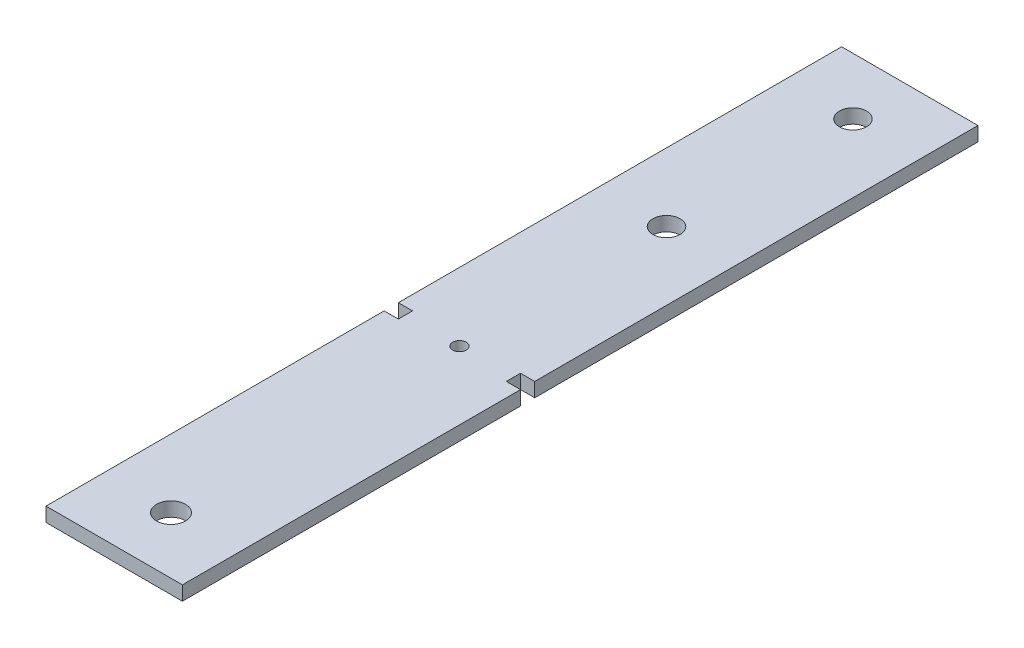
ISO-10303-21;
HEADER;
FILE_DESCRIPTION(('STEP AP214'),'2;1');
FILE_NAME('part.step','',(''),(''),'','','');
FILE_SCHEMA(('AUTOMOTIVE_DESIGN { 1 0 10303 214 1 1 1 1 }'));
ENDSEC;
DATA;
#1=APPLICATION_CONTEXT('core data for automotive mechanical design processes');
#2=APPLICATION_PROTOCOL_DEFINITION('international standard','automotive_design',2000,#1);
#3=PRODUCT_CONTEXT('',#1,'mechanical');
#4=PRODUCT('Part','Part','',(#3));
#5=PRODUCT_RELATED_PRODUCT_CATEGORY('part','',(#4));
#6=PRODUCT_DEFINITION_FORMATION('','',#4);
#7=PRODUCT_DEFINITION_CONTEXT('part definition',#1,'design');
#8=PRODUCT_DEFINITION('design','',#6,#7);
#9=PRODUCT_DEFINITION_SHAPE('','',#8);
#10=(LENGTH_UNIT() NAMED_UNIT(*) SI_UNIT(.MILLI.,.METRE.));
#11=(NAMED_UNIT(*) PLANE_ANGLE_UNIT() SI_UNIT($,.RADIAN.));
#12=(NAMED_UNIT(*) SI_UNIT($,.STERADIAN.) SOLID_ANGLE_UNIT());
#13=UNCERTAINTY_MEASURE_WITH_UNIT(LENGTH_MEASURE(1.E-05),#10,'distance_accuracy_value','');
#14=(GEOMETRIC_REPRESENTATION_CONTEXT(3) GLOBAL_UNCERTAINTY_ASSIGNED_CONTEXT((#13)) GLOBAL_UNIT_ASSIGNED_CONTEXT((#10,
#11,#12)) REPRESENTATION_CONTEXT('',''));
#15=CARTESIAN_POINT('',(0.,0.,0.));
#16=DIRECTION('',(0.,0.,1.));
#17=DIRECTION('',(1.,0.,0.));
#18=AXIS2_PLACEMENT_3D('',#15,#16,#17);
#19=CARTESIAN_POINT('',(-44.5847902895759,3.175,13.335));
#20=DIRECTION('',(0.,-1.,0.));
#21=DIRECTION('',(0.,0.,-1.));
#22=AXIS2_PLACEMENT_3D('',#19,#20,#21);
#23=PLANE('',#22);
#24=CARTESIAN_POINT('',(-32.5197902895764,3.175,11.7475));
#25=DIRECTION('',(0.,1.,0.));
#26=DIRECTION('',(0.,0.,1.));
#27=AXIS2_PLACEMENT_3D('',#24,#25,#26);
#28=CIRCLE('',#27,1.524);
#29=CARTESIAN_POINT('',(-32.5197902895764,3.175,13.2715));
#30=VERTEX_POINT('',#29);
#31=EDGE_CURVE('E291',#30,#30,#28,.T.);
#32=ORIENTED_EDGE('',*,*,#31,.F.);
#33=EDGE_LOOP('',(#32));
#34=FACE_BOUND('',#33,.T.);
#35=CARTESIAN_POINT('',(-32.5197902895762,3.175,-34.5292679999996));
#36=DIRECTION('',(0.,1.,0.));
#37=DIRECTION('',(0.,0.,-1.));
#38=AXIS2_PLACEMENT_3D('',#35,#36,#37);
#39=CIRCLE('',#38,3.048);
#40=CARTESIAN_POINT('',(-32.5197902895762,3.175,-37.5772679999996));
#41=VERTEX_POINT('',#40);
#42=EDGE_CURVE('E157',#41,#41,#39,.T.);
#43=ORIENTED_EDGE('',*,*,#42,.F.);
#44=EDGE_LOOP('',(#43));
#45=FACE_BOUND('',#44,.T.);
#46=DIRECTION('',(0.,0.,1.));
#47=VECTOR('',#46,1.);
#48=CARTESIAN_POINT('',(-44.5847902895759,3.175,10.16));
#49=LINE('',#48,#47);
#50=CARTESIAN_POINT('',(-44.5847902895759,3.175,10.16));
#51=VERTEX_POINT('',#50);
#52=CARTESIAN_POINT('',(-44.5847902895759,3.175,13.335));
#53=VERTEX_POINT('',#52);
#54=EDGE_CURVE('E176',#51,#53,#49,.T.);
#55=ORIENTED_EDGE('',*,*,#54,.T.);
#56=DIRECTION('',(-1.,0.,0.));
#57=VECTOR('',#56,1.);
#58=CARTESIAN_POINT('',(-44.5847902895759,3.175,13.335));
#59=LINE('',#58,#57);
#60=CARTESIAN_POINT('',(-47.7597902895759,3.175,13.335));
#61=VERTEX_POINT('',#60);
#62=EDGE_CURVE('E104',#53,#61,#59,.T.);
#63=ORIENTED_EDGE('',*,*,#62,.T.);
#64=DIRECTION('',(0.,0.,1.));
#65=VECTOR('',#64,1.);
#66=CARTESIAN_POINT('',(-47.7597902895759,3.175,13.335));
#67=LINE('',#66,#65);
#68=CARTESIAN_POINT('',(-47.7597902895759,3.175,88.9));
#69=VERTEX_POINT('',#68);
#70=EDGE_CURVE('E203',#61,#69,#67,.T.);
#71=ORIENTED_EDGE('',*,*,#70,.T.);
#72=DIRECTION('',(1.,0.,0.));
#73=VECTOR('',#72,1.);
#74=CARTESIAN_POINT('',(-17.2797902895759,3.175,88.9));
#75=LINE('',#74,#73);
#76=CARTESIAN_POINT('',(-17.2797902895759,3.175,88.9));
#77=VERTEX_POINT('',#76);
#78=EDGE_CURVE('E222',#69,#77,#75,.T.);
#79=ORIENTED_EDGE('',*,*,#78,.T.);
#80=DIRECTION('',(0.,0.,-1.));
#81=VECTOR('',#80,1.);
#82=CARTESIAN_POINT('',(-17.2797902895759,3.175,13.335));
#83=LINE('',#82,#81);
#84=CARTESIAN_POINT('',(-17.2797902895759,3.175,13.335));
#85=VERTEX_POINT('',#84);
#86=EDGE_CURVE('E219',#77,#85,#83,.T.);
#87=ORIENTED_EDGE('',*,*,#86,.T.);
#88=DIRECTION('',(-1.,0.,0.));
#89=VECTOR('',#88,1.);
#90=CARTESIAN_POINT('',(-17.2797902895759,3.175,13.335));
#91=LINE('',#90,#89);
#92=CARTESIAN_POINT('',(-20.4547902895759,3.175,13.335));
#93=VERTEX_POINT('',#92);
#94=EDGE_CURVE('E221',#85,#93,#91,.T.);
#95=ORIENTED_EDGE('',*,*,#94,.T.);
#96=DIRECTION('',(0.,0.,-1.));
#97=VECTOR('',#96,1.);
#98=CARTESIAN_POINT('',(-20.4547902895759,3.175,13.335));
#99=LINE('',#98,#97);
#100=CARTESIAN_POINT('',(-20.4547902895759,3.175,10.16));
#101=VERTEX_POINT('',#100);
#102=EDGE_CURVE('E224',#93,#101,#99,.T.);
#103=ORIENTED_EDGE('',*,*,#102,.T.);
#104=DIRECTION('',(1.,0.,0.));
#105=VECTOR('',#104,1.);
#106=CARTESIAN_POINT('',(-20.4547902895759,3.175,10.16));
#107=LINE('',#106,#105);
#108=CARTESIAN_POINT('',(-17.2797902895759,3.175,10.16));
#109=VERTEX_POINT('',#108);
#110=EDGE_CURVE('E230',#101,#109,#107,.T.);
#111=ORIENTED_EDGE('',*,*,#110,.T.);
#112=DIRECTION('',(0.,0.,-1.));
#113=VECTOR('',#112,1.);
#114=CARTESIAN_POINT('',(-17.2797902895759,3.175,-88.9));
#115=LINE('',#114,#113);
#116=CARTESIAN_POINT('',(-17.2797902895759,3.175,-88.9));
#117=VERTEX_POINT('',#116);
#118=EDGE_CURVE('E135',#109,#117,#115,.T.);
#119=ORIENTED_EDGE('',*,*,#118,.T.);
#120=DIRECTION('',(-1.,0.,0.));
#121=VECTOR('',#120,1.);
#122=CARTESIAN_POINT('',(-17.2797902895759,3.175,-88.9));
#123=LINE('',#122,#121);
#124=CARTESIAN_POINT('',(-47.7597902895759,3.175,-88.9));
#125=VERTEX_POINT('',#124);
#126=EDGE_CURVE('E129',#117,#125,#123,.T.);
#127=ORIENTED_EDGE('',*,*,#126,.T.);
#128=DIRECTION('',(0.,0.,1.));
#129=VECTOR('',#128,1.);
#130=CARTESIAN_POINT('',(-47.7597902895759,3.175,-88.9));
#131=LINE('',#130,#129);
#132=CARTESIAN_POINT('',(-47.7597902895759,3.175,10.16));
#133=VERTEX_POINT('',#132);
#134=EDGE_CURVE('E133',#125,#133,#131,.T.);
#135=ORIENTED_EDGE('',*,*,#134,.T.);
#136=DIRECTION('',(1.,0.,0.));
#137=VECTOR('',#136,1.);
#138=CARTESIAN_POINT('',(-47.7597902895759,3.175,10.16));
#139=LINE('',#138,#137);
#140=EDGE_CURVE('E49',#133,#51,#139,.T.);
#141=ORIENTED_EDGE('',*,*,#140,.T.);
#142=EDGE_LOOP('',(#55,#63,#71,#79,#87,#95,#103,#111,#119,#127,#135,#141));
#143=FACE_BOUND('',#142,.T.);
#144=CARTESIAN_POINT('',(-32.5197902895764,3.175,-76.1999999999995));
#145=DIRECTION('',(0.,1.,0.));
#146=DIRECTION('',(0.,0.,-1.));
#147=AXIS2_PLACEMENT_3D('',#144,#145,#146);
#148=CIRCLE('',#147,3.048);
#149=CARTESIAN_POINT('',(-32.5197902895764,3.175,-79.2479999999995));
#150=VERTEX_POINT('',#149);
#151=EDGE_CURVE('E297',#150,#150,#148,.T.);
#152=ORIENTED_EDGE('',*,*,#151,.F.);
#153=EDGE_LOOP('',(#152));
#154=FACE_BOUND('',#153,.T.);
#155=CARTESIAN_POINT('',(-32.519790289576,3.175,76.2));
#156=DIRECTION('',(0.,1.,0.));
#157=DIRECTION('',(0.,0.,-1.));
#158=AXIS2_PLACEMENT_3D('',#155,#156,#157);
#159=CIRCLE('',#158,3.2385);
#160=CARTESIAN_POINT('',(-32.519790289576,3.175,72.9615));
#161=VERTEX_POINT('',#160);
#162=EDGE_CURVE('E282',#161,#161,#159,.T.);
#163=ORIENTED_EDGE('',*,*,#162,.F.);
#164=EDGE_LOOP('',(#163));
#165=FACE_BOUND('',#164,.T.);
#166=ADVANCED_FACE('F32',(#34,#45,#143,#154,#165),#23,.F.);
#167=CARTESIAN_POINT('',(-44.5847902895759,0.,13.335));
#168=DIRECTION('',(0.,-1.,0.));
#169=DIRECTION('',(0.,0.,-1.));
#170=AXIS2_PLACEMENT_3D('',#167,#168,#169);
#171=PLANE('',#170);
#172=CARTESIAN_POINT('',(-32.5197902895764,0.,11.7475));
#173=DIRECTION('',(0.,1.,0.));
#174=DIRECTION('',(0.,0.,1.));
#175=AXIS2_PLACEMENT_3D('',#172,#173,#174);
#176=CIRCLE('',#175,1.524);
#177=CARTESIAN_POINT('',(-32.5197902895764,0.,13.2715));
#178=VERTEX_POINT('',#177);
#179=EDGE_CURVE('E288',#178,#178,#176,.T.);
#180=ORIENTED_EDGE('',*,*,#179,.T.);
#181=EDGE_LOOP('',(#180));
#182=FACE_BOUND('',#181,.T.);
#183=CARTESIAN_POINT('',(-32.5197902895762,0.,-34.5292679999996));
#184=DIRECTION('',(0.,1.,0.));
#185=DIRECTION('',(0.,0.,-1.));
#186=AXIS2_PLACEMENT_3D('',#183,#184,#185);
#187=CIRCLE('',#186,3.048);
#188=CARTESIAN_POINT('',(-32.5197902895762,0.,-37.5772679999996));
#189=VERTEX_POINT('',#188);
#190=EDGE_CURVE('E300',#189,#189,#187,.T.);
#191=ORIENTED_EDGE('',*,*,#190,.T.);
#192=EDGE_LOOP('',(#191));
#193=FACE_BOUND('',#192,.T.);
#194=DIRECTION('',(0.,0.,1.));
#195=VECTOR('',#194,1.);
#196=CARTESIAN_POINT('',(-44.5847902895759,0.,10.16));
#197=LINE('',#196,#195);
#198=CARTESIAN_POINT('',(-44.5847902895759,0.,10.16));
#199=VERTEX_POINT('',#198);
#200=CARTESIAN_POINT('',(-44.5847902895759,0.,13.335));
#201=VERTEX_POINT('',#200);
#202=EDGE_CURVE('E153',#199,#201,#197,.T.);
#203=ORIENTED_EDGE('',*,*,#202,.F.);
#204=DIRECTION('',(1.,0.,0.));
#205=VECTOR('',#204,1.);
#206=CARTESIAN_POINT('',(-47.7597902895759,0.,10.16));
#207=LINE('',#206,#205);
#208=CARTESIAN_POINT('',(-47.7597902895759,0.,10.16));
#209=VERTEX_POINT('',#208);
#210=EDGE_CURVE('E96',#209,#199,#207,.T.);
#211=ORIENTED_EDGE('',*,*,#210,.F.);
#212=DIRECTION('',(0.,0.,1.));
#213=VECTOR('',#212,1.);
#214=CARTESIAN_POINT('',(-47.7597902895759,0.,-88.9));
#215=LINE('',#214,#213);
#216=CARTESIAN_POINT('',(-47.7597902895759,0.,-88.9));
#217=VERTEX_POINT('',#216);
#218=EDGE_CURVE('E90',#217,#209,#215,.T.);
#219=ORIENTED_EDGE('',*,*,#218,.F.);
#220=DIRECTION('',(-1.,0.,0.));
#221=VECTOR('',#220,1.);
#222=CARTESIAN_POINT('',(-17.2797902895759,0.,-88.9));
#223=LINE('',#222,#221);
#224=CARTESIAN_POINT('',(-17.2797902895759,0.,-88.9));
#225=VERTEX_POINT('',#224);
#226=EDGE_CURVE('E143',#225,#217,#223,.T.);
#227=ORIENTED_EDGE('',*,*,#226,.F.);
#228=DIRECTION('',(0.,0.,-1.));
#229=VECTOR('',#228,1.);
#230=CARTESIAN_POINT('',(-17.2797902895759,0.,-88.9));
#231=LINE('',#230,#229);
#232=CARTESIAN_POINT('',(-17.2797902895759,0.,10.16));
#233=VERTEX_POINT('',#232);
#234=EDGE_CURVE('E171',#233,#225,#231,.T.);
#235=ORIENTED_EDGE('',*,*,#234,.F.);
#236=DIRECTION('',(1.,0.,0.));
#237=VECTOR('',#236,1.);
#238=CARTESIAN_POINT('',(-20.4547902895759,0.,10.16));
#239=LINE('',#238,#237);
#240=CARTESIAN_POINT('',(-20.4547902895759,0.,10.16));
#241=VERTEX_POINT('',#240);
#242=EDGE_CURVE('E169',#241,#233,#239,.T.);
#243=ORIENTED_EDGE('',*,*,#242,.F.);
#244=DIRECTION('',(0.,0.,-1.));
#245=VECTOR('',#244,1.);
#246=CARTESIAN_POINT('',(-20.4547902895759,0.,13.335));
#247=LINE('',#246,#245);
#248=CARTESIAN_POINT('',(-20.4547902895759,0.,13.335));
#249=VERTEX_POINT('',#248);
#250=EDGE_CURVE('E167',#249,#241,#247,.T.);
#251=ORIENTED_EDGE('',*,*,#250,.F.);
#252=DIRECTION('',(-1.,0.,0.));
#253=VECTOR('',#252,1.);
#254=CARTESIAN_POINT('',(-17.2797902895759,0.,13.335));
#255=LINE('',#254,#253);
#256=CARTESIAN_POINT('',(-17.2797902895759,0.,13.335));
#257=VERTEX_POINT('',#256);
#258=EDGE_CURVE('E165',#257,#249,#255,.T.);
#259=ORIENTED_EDGE('',*,*,#258,.F.);
#260=DIRECTION('',(0.,0.,-1.));
#261=VECTOR('',#260,1.);
#262=CARTESIAN_POINT('',(-17.2797902895759,0.,13.335));
#263=LINE('',#262,#261);
#264=CARTESIAN_POINT('',(-17.2797902895759,0.,88.9));
#265=VERTEX_POINT('',#264);
#266=EDGE_CURVE('E163',#265,#257,#263,.T.);
#267=ORIENTED_EDGE('',*,*,#266,.F.);
#268=DIRECTION('',(1.,0.,0.));
#269=VECTOR('',#268,1.);
#270=CARTESIAN_POINT('',(-17.2797902895759,0.,88.9));
#271=LINE('',#270,#269);
#272=CARTESIAN_POINT('',(-47.7597902895759,0.,88.9));
#273=VERTEX_POINT('',#272);
#274=EDGE_CURVE('E161',#273,#265,#271,.T.);
#275=ORIENTED_EDGE('',*,*,#274,.F.);
#276=DIRECTION('',(0.,0.,1.));
#277=VECTOR('',#276,1.);
#278=CARTESIAN_POINT('',(-47.7597902895759,0.,13.335));
#279=LINE('',#278,#277);
#280=CARTESIAN_POINT('',(-47.7597902895759,0.,13.335));
#281=VERTEX_POINT('',#280);
#282=EDGE_CURVE('E159',#281,#273,#279,.T.);
#283=ORIENTED_EDGE('',*,*,#282,.F.);
#284=DIRECTION('',(-1.,0.,0.));
#285=VECTOR('',#284,1.);
#286=CARTESIAN_POINT('',(-44.5847902895759,0.,13.335));
#287=LINE('',#286,#285);
#288=EDGE_CURVE('E156',#201,#281,#287,.T.);
#289=ORIENTED_EDGE('',*,*,#288,.F.);
#290=EDGE_LOOP('',(#203,#211,#219,#227,#235,#243,#251,#259,#267,#275,#283,#289));
#291=FACE_BOUND('',#290,.T.);
#292=CARTESIAN_POINT('',(-32.5197902895764,0.,-76.1999999999995));
#293=DIRECTION('',(0.,1.,0.));
#294=DIRECTION('',(0.,0.,-1.));
#295=AXIS2_PLACEMENT_3D('',#292,#293,#294);
#296=CIRCLE('',#295,3.048);
#297=CARTESIAN_POINT('',(-32.5197902895764,0.,-79.2479999999995));
#298=VERTEX_POINT('',#297);
#299=EDGE_CURVE('E294',#298,#298,#296,.T.);
#300=ORIENTED_EDGE('',*,*,#299,.T.);
#301=EDGE_LOOP('',(#300));
#302=FACE_BOUND('',#301,.T.);
#303=CARTESIAN_POINT('',(-32.519790289576,0.,76.2));
#304=DIRECTION('',(0.,1.,0.));
#305=DIRECTION('',(0.,0.,-1.));
#306=AXIS2_PLACEMENT_3D('',#303,#304,#305);
#307=CIRCLE('',#306,3.2385);
#308=CARTESIAN_POINT('',(-32.519790289576,0.,72.9615));
#309=VERTEX_POINT('',#308);
#310=EDGE_CURVE('E285',#309,#309,#307,.T.);
#311=ORIENTED_EDGE('',*,*,#310,.T.);
#312=EDGE_LOOP('',(#311));
#313=FACE_BOUND('',#312,.T.);
#314=ADVANCED_FACE('F207',(#182,#193,#291,#302,#313),#171,.T.);
#315=CARTESIAN_POINT('',(-44.5847902895759,3.175,10.16));
#316=DIRECTION('',(1.,0.,0.));
#317=DIRECTION('',(0.,0.,-1.));
#318=AXIS2_PLACEMENT_3D('',#315,#316,#317);
#319=PLANE('',#318);
#320=ORIENTED_EDGE('',*,*,#202,.T.);
#321=DIRECTION('',(0.,-1.,0.));
#322=VECTOR('',#321,1.);
#323=CARTESIAN_POINT('',(-44.5847902895759,3.175,13.335));
#324=LINE('',#323,#322);
#325=EDGE_CURVE('E11',#53,#201,#324,.T.);
#326=ORIENTED_EDGE('',*,*,#325,.F.);
#327=ORIENTED_EDGE('',*,*,#54,.F.);
#328=DIRECTION('',(0.,-1.,0.));
#329=VECTOR('',#328,1.);
#330=CARTESIAN_POINT('',(-44.5847902895759,3.175,10.16));
#331=LINE('',#330,#329);
#332=EDGE_CURVE('E149',#51,#199,#331,.T.);
#333=ORIENTED_EDGE('',*,*,#332,.T.);
#334=EDGE_LOOP('',(#320,#326,#327,#333));
#335=FACE_BOUND('',#334,.T.);
#336=ADVANCED_FACE('F34',(#335),#319,.F.);
#337=CARTESIAN_POINT('',(-44.5847902895759,3.175,13.335));
#338=DIRECTION('',(0.,0.,1.));
#339=DIRECTION('',(1.,0.,0.));
#340=AXIS2_PLACEMENT_3D('',#337,#338,#339);
#341=PLANE('',#340);
#342=ORIENTED_EDGE('',*,*,#288,.T.);
#343=DIRECTION('',(0.,-1.,0.));
#344=VECTOR('',#343,1.);
#345=CARTESIAN_POINT('',(-47.7597902895759,3.175,13.335));
#346=LINE('',#345,#344);
#347=EDGE_CURVE('E41',#61,#281,#346,.T.);
#348=ORIENTED_EDGE('',*,*,#347,.F.);
#349=ORIENTED_EDGE('',*,*,#62,.F.);
#350=ORIENTED_EDGE('',*,*,#325,.T.);
#351=EDGE_LOOP('',(#342,#348,#349,#350));
#352=FACE_BOUND('',#351,.T.);
#353=ADVANCED_FACE('F409',(#352),#341,.F.);
#354=CARTESIAN_POINT('',(-47.7597902895759,3.175,13.335));
#355=DIRECTION('',(1.,0.,0.));
#356=DIRECTION('',(0.,0.,-1.));
#357=AXIS2_PLACEMENT_3D('',#354,#355,#356);
#358=PLANE('',#357);
#359=ORIENTED_EDGE('',*,*,#282,.T.);
#360=DIRECTION('',(0.,-1.,0.));
#361=VECTOR('',#360,1.);
#362=CARTESIAN_POINT('',(-47.7597902895759,3.175,88.9));
#363=LINE('',#362,#361);
#364=EDGE_CURVE('E195',#69,#273,#363,.T.);
#365=ORIENTED_EDGE('',*,*,#364,.F.);
#366=ORIENTED_EDGE('',*,*,#70,.F.);
#367=ORIENTED_EDGE('',*,*,#347,.T.);
#368=EDGE_LOOP('',(#359,#365,#366,#367));
#369=FACE_BOUND('',#368,.T.);
#370=ADVANCED_FACE('F201',(#369),#358,.F.);
#371=CARTESIAN_POINT('',(-17.2797902895759,3.175,88.9));
#372=DIRECTION('',(0.,0.,-1.));
#373=DIRECTION('',(-1.,0.,0.));
#374=AXIS2_PLACEMENT_3D('',#371,#372,#373);
#375=PLANE('',#374);
#376=ORIENTED_EDGE('',*,*,#274,.T.);
#377=DIRECTION('',(0.,-1.,0.));
#378=VECTOR('',#377,1.);
#379=CARTESIAN_POINT('',(-17.2797902895759,3.175,88.9));
#380=LINE('',#379,#378);
#381=EDGE_CURVE('E192',#77,#265,#380,.T.);
#382=ORIENTED_EDGE('',*,*,#381,.F.);
#383=ORIENTED_EDGE('',*,*,#78,.F.);
#384=ORIENTED_EDGE('',*,*,#364,.T.);
#385=EDGE_LOOP('',(#376,#382,#383,#384));
#386=FACE_BOUND('',#385,.T.);
#387=ADVANCED_FACE('F213',(#386),#375,.F.);
#388=CARTESIAN_POINT('',(-17.2797902895759,3.175,13.335));
#389=DIRECTION('',(-1.,0.,0.));
#390=DIRECTION('',(0.,0.,1.));
#391=AXIS2_PLACEMENT_3D('',#388,#389,#390);
#392=PLANE('',#391);
#393=ORIENTED_EDGE('',*,*,#266,.T.);
#394=DIRECTION('',(0.,-1.,0.));
#395=VECTOR('',#394,1.);
#396=CARTESIAN_POINT('',(-17.2797902895759,3.175,13.335));
#397=LINE('',#396,#395);
#398=EDGE_CURVE('E189',#85,#257,#397,.T.);
#399=ORIENTED_EDGE('',*,*,#398,.F.);
#400=ORIENTED_EDGE('',*,*,#86,.F.);
#401=ORIENTED_EDGE('',*,*,#381,.T.);
#402=EDGE_LOOP('',(#393,#399,#400,#401));
#403=FACE_BOUND('',#402,.T.);
#404=ADVANCED_FACE('F217',(#403),#392,.F.);
#405=CARTESIAN_POINT('',(-17.2797902895759,3.175,13.335));
#406=DIRECTION('',(0.,0.,1.));
#407=DIRECTION('',(1.,0.,0.));
#408=AXIS2_PLACEMENT_3D('',#405,#406,#407);
#409=PLANE('',#408);
#410=ORIENTED_EDGE('',*,*,#258,.T.);
#411=DIRECTION('',(0.,-1.,0.));
#412=VECTOR('',#411,1.);
#413=CARTESIAN_POINT('',(-20.4547902895759,3.175,13.335));
#414=LINE('',#413,#412);
#415=EDGE_CURVE('E186',#93,#249,#414,.T.);
#416=ORIENTED_EDGE('',*,*,#415,.F.);
#417=ORIENTED_EDGE('',*,*,#94,.F.);
#418=ORIENTED_EDGE('',*,*,#398,.T.);
#419=EDGE_LOOP('',(#410,#416,#417,#418));
#420=FACE_BOUND('',#419,.T.);
#421=ADVANCED_FACE('F374',(#420),#409,.F.);
#422=CARTESIAN_POINT('',(-20.4547902895759,3.175,13.335));
#423=DIRECTION('',(-1.,0.,0.));
#424=DIRECTION('',(0.,0.,1.));
#425=AXIS2_PLACEMENT_3D('',#422,#423,#424);
#426=PLANE('',#425);
#427=ORIENTED_EDGE('',*,*,#250,.T.);
#428=DIRECTION('',(0.,-1.,0.));
#429=VECTOR('',#428,1.);
#430=CARTESIAN_POINT('',(-20.4547902895759,3.175,10.16));
#431=LINE('',#430,#429);
#432=EDGE_CURVE('E183',#101,#241,#431,.T.);
#433=ORIENTED_EDGE('',*,*,#432,.F.);
#434=ORIENTED_EDGE('',*,*,#102,.F.);
#435=ORIENTED_EDGE('',*,*,#415,.T.);
#436=EDGE_LOOP('',(#427,#433,#434,#435));
#437=FACE_BOUND('',#436,.T.);
#438=ADVANCED_FACE('F365',(#437),#426,.F.);
#439=CARTESIAN_POINT('',(-20.4547902895759,3.175,10.16));
#440=DIRECTION('',(0.,0.,-1.));
#441=DIRECTION('',(-1.,0.,0.));
#442=AXIS2_PLACEMENT_3D('',#439,#440,#441);
#443=PLANE('',#442);
#444=ORIENTED_EDGE('',*,*,#242,.T.);
#445=DIRECTION('',(0.,-1.,0.));
#446=VECTOR('',#445,1.);
#447=CARTESIAN_POINT('',(-17.2797902895759,3.175,10.16));
#448=LINE('',#447,#446);
#449=EDGE_CURVE('E180',#109,#233,#448,.T.);
#450=ORIENTED_EDGE('',*,*,#449,.F.);
#451=ORIENTED_EDGE('',*,*,#110,.F.);
#452=ORIENTED_EDGE('',*,*,#432,.T.);
#453=EDGE_LOOP('',(#444,#450,#451,#452));
#454=FACE_BOUND('',#453,.T.);
#455=ADVANCED_FACE('F236',(#454),#443,.F.);
#456=CARTESIAN_POINT('',(-17.2797902895759,3.175,-88.9));
#457=DIRECTION('',(-1.,0.,0.));
#458=DIRECTION('',(0.,0.,1.));
#459=AXIS2_PLACEMENT_3D('',#456,#457,#458);
#460=PLANE('',#459);
#461=ORIENTED_EDGE('',*,*,#234,.T.);
#462=DIRECTION('',(0.,-1.,0.));
#463=VECTOR('',#462,1.);
#464=CARTESIAN_POINT('',(-17.2797902895759,3.175,-88.9));
#465=LINE('',#464,#463);
#466=EDGE_CURVE('E144',#117,#225,#465,.T.);
#467=ORIENTED_EDGE('',*,*,#466,.F.);
#468=ORIENTED_EDGE('',*,*,#118,.F.);
#469=ORIENTED_EDGE('',*,*,#449,.T.);
#470=EDGE_LOOP('',(#461,#467,#468,#469));
#471=FACE_BOUND('',#470,.T.);
#472=ADVANCED_FACE('F240',(#471),#460,.F.);
#473=CARTESIAN_POINT('',(-17.2797902895759,3.175,-88.9));
#474=DIRECTION('',(0.,0.,1.));
#475=DIRECTION('',(1.,0.,0.));
#476=AXIS2_PLACEMENT_3D('',#473,#474,#475);
#477=PLANE('',#476);
#478=ORIENTED_EDGE('',*,*,#226,.T.);
#479=DIRECTION('',(0.,-1.,0.));
#480=VECTOR('',#479,1.);
#481=CARTESIAN_POINT('',(-47.7597902895759,3.175,-88.9));
#482=LINE('',#481,#480);
#483=EDGE_CURVE('E140',#125,#217,#482,.T.);
#484=ORIENTED_EDGE('',*,*,#483,.F.);
#485=ORIENTED_EDGE('',*,*,#126,.F.);
#486=ORIENTED_EDGE('',*,*,#466,.T.);
#487=EDGE_LOOP('',(#478,#484,#485,#486));
#488=FACE_BOUND('',#487,.T.);
#489=ADVANCED_FACE('F141',(#488),#477,.F.);
#490=CARTESIAN_POINT('',(-47.7597902895759,3.175,-88.9));
#491=DIRECTION('',(1.,0.,0.));
#492=DIRECTION('',(0.,0.,-1.));
#493=AXIS2_PLACEMENT_3D('',#490,#491,#492);
#494=PLANE('',#493);
#495=ORIENTED_EDGE('',*,*,#218,.T.);
#496=DIRECTION('',(0.,-1.,0.));
#497=VECTOR('',#496,1.);
#498=CARTESIAN_POINT('',(-47.7597902895759,3.175,10.16));
#499=LINE('',#498,#497);
#500=EDGE_CURVE('E145',#133,#209,#499,.T.);
#501=ORIENTED_EDGE('',*,*,#500,.F.);
#502=ORIENTED_EDGE('',*,*,#134,.F.);
#503=ORIENTED_EDGE('',*,*,#483,.T.);
#504=EDGE_LOOP('',(#495,#501,#502,#503));
#505=FACE_BOUND('',#504,.T.);
#506=ADVANCED_FACE('F147',(#505),#494,.F.);
#507=CARTESIAN_POINT('',(-47.7597902895759,3.175,10.16));
#508=DIRECTION('',(0.,0.,-1.));
#509=DIRECTION('',(-1.,0.,0.));
#510=AXIS2_PLACEMENT_3D('',#507,#508,#509);
#511=PLANE('',#510);
#512=ORIENTED_EDGE('',*,*,#210,.T.);
#513=ORIENTED_EDGE('',*,*,#332,.F.);
#514=ORIENTED_EDGE('',*,*,#140,.F.);
#515=ORIENTED_EDGE('',*,*,#500,.T.);
#516=EDGE_LOOP('',(#512,#513,#514,#515));
#517=FACE_BOUND('',#516,.T.);
#518=ADVANCED_FACE('F244',(#517),#511,.F.);
#519=CARTESIAN_POINT('',(-32.5197902895762,3.175,-34.5292679999996));
#520=DIRECTION('',(0.,-1.,0.));
#521=DIRECTION('',(0.,0.,-1.));
#522=AXIS2_PLACEMENT_3D('',#519,#520,#521);
#523=CYLINDRICAL_SURFACE('',#522,3.048);
#524=ORIENTED_EDGE('',*,*,#42,.T.);
#525=EDGE_LOOP('',(#524));
#526=FACE_BOUND('',#525,.T.);
#527=ORIENTED_EDGE('',*,*,#190,.F.);
#528=EDGE_LOOP('',(#527));
#529=FACE_BOUND('',#528,.T.);
#530=ADVANCED_FACE('F246',(#526,#529),#523,.F.);
#531=CARTESIAN_POINT('',(-32.5197902895764,3.175,-76.1999999999995));
#532=DIRECTION('',(0.,-1.,0.));
#533=DIRECTION('',(0.,0.,-1.));
#534=AXIS2_PLACEMENT_3D('',#531,#532,#533);
#535=CYLINDRICAL_SURFACE('',#534,3.048);
#536=ORIENTED_EDGE('',*,*,#151,.T.);
#537=EDGE_LOOP('',(#536));
#538=FACE_BOUND('',#537,.T.);
#539=ORIENTED_EDGE('',*,*,#299,.F.);
#540=EDGE_LOOP('',(#539));
#541=FACE_BOUND('',#540,.T.);
#542=ADVANCED_FACE('F252',(#538,#541),#535,.F.);
#543=CARTESIAN_POINT('',(-32.5197902895764,3.175,11.7475));
#544=DIRECTION('',(0.,-1.,0.));
#545=DIRECTION('',(0.,0.,-1.));
#546=AXIS2_PLACEMENT_3D('',#543,#544,#545);
#547=CYLINDRICAL_SURFACE('',#546,1.524);
#548=ORIENTED_EDGE('',*,*,#31,.T.);
#549=EDGE_LOOP('',(#548));
#550=FACE_BOUND('',#549,.T.);
#551=ORIENTED_EDGE('',*,*,#179,.F.);
#552=EDGE_LOOP('',(#551));
#553=FACE_BOUND('',#552,.T.);
#554=ADVANCED_FACE('F269',(#550,#553),#547,.F.);
#555=CARTESIAN_POINT('',(-32.519790289576,3.175,76.2));
#556=DIRECTION('',(0.,-1.,0.));
#557=DIRECTION('',(0.,0.,-1.));
#558=AXIS2_PLACEMENT_3D('',#555,#556,#557);
#559=CYLINDRICAL_SURFACE('',#558,3.2385);
#560=ORIENTED_EDGE('',*,*,#162,.T.);
#561=EDGE_LOOP('',(#560));
#562=FACE_BOUND('',#561,.T.);
#563=ORIENTED_EDGE('',*,*,#310,.F.);
#564=EDGE_LOOP('',(#563));
#565=FACE_BOUND('',#564,.T.);
#566=ADVANCED_FACE('F273',(#562,#565),#559,.F.);
#567=CLOSED_SHELL('',(#166,#314,#336,#353,#370,#387,#404,#421,#438,#455,#472,#489,#506,#518,
#530,#542,#554,#566));
#568=MANIFOLD_SOLID_BREP('B2',#567);
#569=ADVANCED_BREP_SHAPE_REPRESENTATION('',(#18,#568),#14);
#570=SHAPE_DEFINITION_REPRESENTATION(#9,#569);
ENDSEC;
END-ISO-10303-21;
